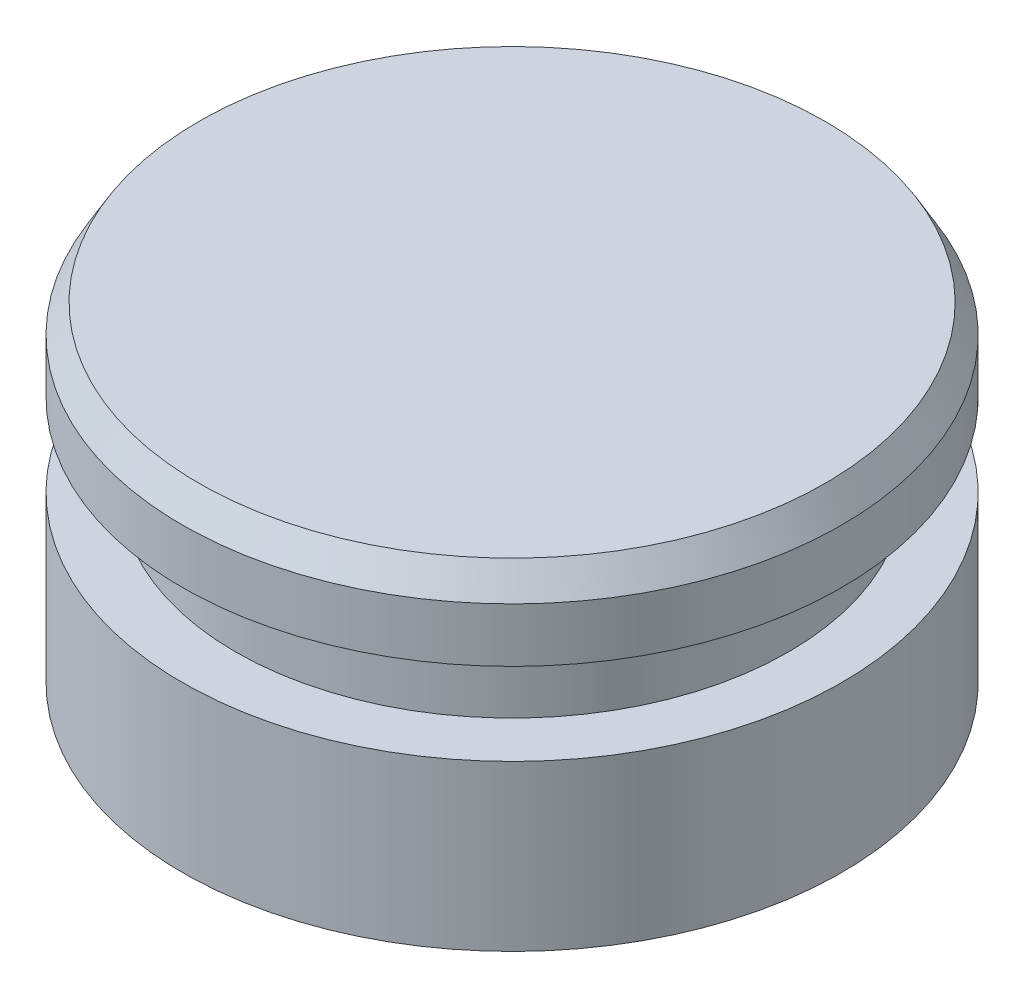
ISO-10303-21;
HEADER;
FILE_DESCRIPTION(('STEP AP214'),'2;1');
FILE_NAME('part.step','',(''),(''),'','','');
FILE_SCHEMA(('AUTOMOTIVE_DESIGN { 1 0 10303 214 1 1 1 1 }'));
ENDSEC;
DATA;
#1=APPLICATION_CONTEXT('core data for automotive mechanical design processes');
#2=APPLICATION_PROTOCOL_DEFINITION('international standard','automotive_design',2000,#1);
#3=PRODUCT_CONTEXT('',#1,'mechanical');
#4=PRODUCT('Part','Part','',(#3));
#5=PRODUCT_RELATED_PRODUCT_CATEGORY('part','',(#4));
#6=PRODUCT_DEFINITION_FORMATION('','',#4);
#7=PRODUCT_DEFINITION_CONTEXT('part definition',#1,'design');
#8=PRODUCT_DEFINITION('design','',#6,#7);
#9=PRODUCT_DEFINITION_SHAPE('','',#8);
#10=(LENGTH_UNIT() NAMED_UNIT(*) SI_UNIT(.MILLI.,.METRE.));
#11=(NAMED_UNIT(*) PLANE_ANGLE_UNIT() SI_UNIT($,.RADIAN.));
#12=(NAMED_UNIT(*) SI_UNIT($,.STERADIAN.) SOLID_ANGLE_UNIT());
#13=UNCERTAINTY_MEASURE_WITH_UNIT(LENGTH_MEASURE(1.E-05),#10,'distance_accuracy_value','');
#14=(GEOMETRIC_REPRESENTATION_CONTEXT(3) GLOBAL_UNCERTAINTY_ASSIGNED_CONTEXT((#13)) GLOBAL_UNIT_ASSIGNED_CONTEXT((#10,
#11,#12)) REPRESENTATION_CONTEXT('',''));
#15=CARTESIAN_POINT('',(0.,0.,0.));
#16=DIRECTION('',(0.,0.,1.));
#17=DIRECTION('',(1.,0.,0.));
#18=AXIS2_PLACEMENT_3D('',#15,#16,#17);
#19=CARTESIAN_POINT('',(0.,0.,0.));
#20=DIRECTION('',(0.,1.,0.));
#21=DIRECTION('',(0.,0.,1.));
#22=AXIS2_PLACEMENT_3D('',#19,#20,#21);
#23=PLANE('',#22);
#24=CARTESIAN_POINT('',(0.,0.,0.));
#25=DIRECTION('',(0.,-1.,0.));
#26=DIRECTION('',(0.,0.,-1.));
#27=AXIS2_PLACEMENT_3D('',#24,#25,#26);
#28=CIRCLE('',#27,9.5377);
#29=CARTESIAN_POINT('',(0.,0.,-9.5377));
#30=VERTEX_POINT('',#29);
#31=EDGE_CURVE('E42',#30,#30,#28,.T.);
#32=ORIENTED_EDGE('',*,*,#31,.T.);
#33=EDGE_LOOP('',(#32));
#34=FACE_BOUND('',#33,.T.);
#35=ADVANCED_FACE('F31',(#34),#23,.F.);
#36=CARTESIAN_POINT('',(0.,0.,0.));
#37=DIRECTION('',(0.,-1.,0.));
#38=DIRECTION('',(0.,0.,-1.));
#39=AXIS2_PLACEMENT_3D('',#36,#37,#38);
#40=CYLINDRICAL_SURFACE('',#39,9.5377);
#41=ORIENTED_EDGE('',*,*,#31,.F.);
#42=EDGE_LOOP('',(#41));
#43=FACE_BOUND('',#42,.T.);
#44=CARTESIAN_POINT('',(0.,4.7625,0.));
#45=DIRECTION('',(0.,-1.,0.));
#46=DIRECTION('',(0.,0.,-1.));
#47=AXIS2_PLACEMENT_3D('',#44,#45,#46);
#48=CIRCLE('',#47,9.5377);
#49=CARTESIAN_POINT('',(0.,4.7625,-9.5377));
#50=VERTEX_POINT('',#49);
#51=EDGE_CURVE('E46',#50,#50,#48,.T.);
#52=ORIENTED_EDGE('',*,*,#51,.T.);
#53=EDGE_LOOP('',(#52));
#54=FACE_BOUND('',#53,.T.);
#55=ADVANCED_FACE('F76',(#43,#54),#40,.T.);
#56=CARTESIAN_POINT('',(-8.001,4.7625,0.));
#57=DIRECTION('',(0.,-1.,0.));
#58=DIRECTION('',(0.,0.,-1.));
#59=AXIS2_PLACEMENT_3D('',#56,#57,#58);
#60=PLANE('',#59);
#61=ORIENTED_EDGE('',*,*,#51,.F.);
#62=EDGE_LOOP('',(#61));
#63=FACE_BOUND('',#62,.T.);
#64=CARTESIAN_POINT('',(0.,4.7625,0.));
#65=DIRECTION('',(0.,-1.,0.));
#66=DIRECTION('',(0.,0.,-1.));
#67=AXIS2_PLACEMENT_3D('',#64,#65,#66);
#68=CIRCLE('',#67,8.001);
#69=CARTESIAN_POINT('',(0.,4.7625,-8.001));
#70=VERTEX_POINT('',#69);
#71=EDGE_CURVE('E51',#70,#70,#68,.T.);
#72=ORIENTED_EDGE('',*,*,#71,.T.);
#73=EDGE_LOOP('',(#72));
#74=FACE_BOUND('',#73,.T.);
#75=ADVANCED_FACE('F81',(#63,#74),#60,.F.);
#76=CARTESIAN_POINT('',(0.,0.,0.));
#77=DIRECTION('',(0.,-1.,0.));
#78=DIRECTION('',(0.,0.,-1.));
#79=AXIS2_PLACEMENT_3D('',#76,#77,#78);
#80=CYLINDRICAL_SURFACE('',#79,8.001);
#81=ORIENTED_EDGE('',*,*,#71,.F.);
#82=EDGE_LOOP('',(#81));
#83=FACE_BOUND('',#82,.T.);
#84=CARTESIAN_POINT('',(0.,7.14375,0.));
#85=DIRECTION('',(0.,-1.,0.));
#86=DIRECTION('',(0.,0.,-1.));
#87=AXIS2_PLACEMENT_3D('',#84,#85,#86);
#88=CIRCLE('',#87,8.001);
#89=CARTESIAN_POINT('',(0.,7.14375,-8.001));
#90=VERTEX_POINT('',#89);
#91=EDGE_CURVE('E54',#90,#90,#88,.T.);
#92=ORIENTED_EDGE('',*,*,#91,.T.);
#93=EDGE_LOOP('',(#92));
#94=FACE_BOUND('',#93,.T.);
#95=ADVANCED_FACE('F72',(#83,#94),#80,.T.);
#96=CARTESIAN_POINT('',(-8.001,7.14375,0.));
#97=DIRECTION('',(0.,1.,0.));
#98=DIRECTION('',(0.,0.,1.));
#99=AXIS2_PLACEMENT_3D('',#96,#97,#98);
#100=PLANE('',#99);
#101=ORIENTED_EDGE('',*,*,#91,.F.);
#102=EDGE_LOOP('',(#101));
#103=FACE_BOUND('',#102,.T.);
#104=CARTESIAN_POINT('',(0.,7.14375,0.));
#105=DIRECTION('',(0.,-1.,0.));
#106=DIRECTION('',(0.,0.,-1.));
#107=AXIS2_PLACEMENT_3D('',#104,#105,#106);
#108=CIRCLE('',#107,9.5377);
#109=CARTESIAN_POINT('',(0.,7.14375,-9.5377));
#110=VERTEX_POINT('',#109);
#111=EDGE_CURVE('E57',#110,#110,#108,.T.);
#112=ORIENTED_EDGE('',*,*,#111,.T.);
#113=EDGE_LOOP('',(#112));
#114=FACE_BOUND('',#113,.T.);
#115=ADVANCED_FACE('F61',(#103,#114),#100,.F.);
#116=CARTESIAN_POINT('',(0.,0.,0.));
#117=DIRECTION('',(0.,-1.,0.));
#118=DIRECTION('',(0.,0.,-1.));
#119=AXIS2_PLACEMENT_3D('',#116,#117,#118);
#120=CYLINDRICAL_SURFACE('',#119,9.5377);
#121=CARTESIAN_POINT('',(0.,8.71029462014352,0.));
#122=DIRECTION('',(0.,-1.,0.));
#123=DIRECTION('',(0.,0.,-1.));
#124=AXIS2_PLACEMENT_3D('',#121,#122,#123);
#125=CIRCLE('',#124,9.5377);
#126=CARTESIAN_POINT('',(0.,8.71029462014352,-9.5377));
#127=VERTEX_POINT('',#126);
#128=EDGE_CURVE('E38',#127,#127,#125,.T.);
#129=ORIENTED_EDGE('',*,*,#128,.T.);
#130=EDGE_LOOP('',(#129));
#131=FACE_BOUND('',#130,.T.);
#132=ORIENTED_EDGE('',*,*,#111,.F.);
#133=EDGE_LOOP('',(#132));
#134=FACE_BOUND('',#133,.T.);
#135=ADVANCED_FACE('F63',(#131,#134),#120,.T.);
#136=CARTESIAN_POINT('',(-9.5377,9.525,0.));
#137=DIRECTION('',(0.,-1.,0.));
#138=DIRECTION('',(0.,0.,-1.));
#139=AXIS2_PLACEMENT_3D('',#136,#137,#138);
#140=PLANE('',#139);
#141=CARTESIAN_POINT('',(0.,9.525,0.));
#142=DIRECTION('',(0.,-1.,0.));
#143=DIRECTION('',(0.,0.,-1.));
#144=AXIS2_PLACEMENT_3D('',#141,#142,#143);
#145=CIRCLE('',#144,9.06732962962962);
#146=CARTESIAN_POINT('',(0.,9.525,-9.06732962962962));
#147=VERTEX_POINT('',#146);
#148=EDGE_CURVE('E10',#147,#147,#145,.F.);
#149=ORIENTED_EDGE('',*,*,#148,.T.);
#150=EDGE_LOOP('',(#149));
#151=FACE_BOUND('',#150,.T.);
#152=ADVANCED_FACE('F65',(#151),#140,.F.);
#153=CARTESIAN_POINT('',(0.,8.71029462014352,0.));
#154=DIRECTION('',(0.,-1.,0.));
#155=DIRECTION('',(0.,0.,-1.));
#156=AXIS2_PLACEMENT_3D('',#153,#154,#155);
#157=CONICAL_SURFACE('',#156,9.5377,0.5235987755983);
#158=ORIENTED_EDGE('',*,*,#148,.F.);
#159=EDGE_LOOP('',(#158));
#160=FACE_BOUND('',#159,.T.);
#161=ORIENTED_EDGE('',*,*,#128,.F.);
#162=EDGE_LOOP('',(#161));
#163=FACE_BOUND('',#162,.T.);
#164=ADVANCED_FACE('F33',(#160,#163),#157,.T.);
#165=CLOSED_SHELL('',(#35,#55,#75,#95,#115,#135,#152,#164));
#166=MANIFOLD_SOLID_BREP('B2',#165);
#167=ADVANCED_BREP_SHAPE_REPRESENTATION('',(#18,#166),#14);
#168=SHAPE_DEFINITION_REPRESENTATION(#9,#167);
ENDSEC;
END-ISO-10303-21;
